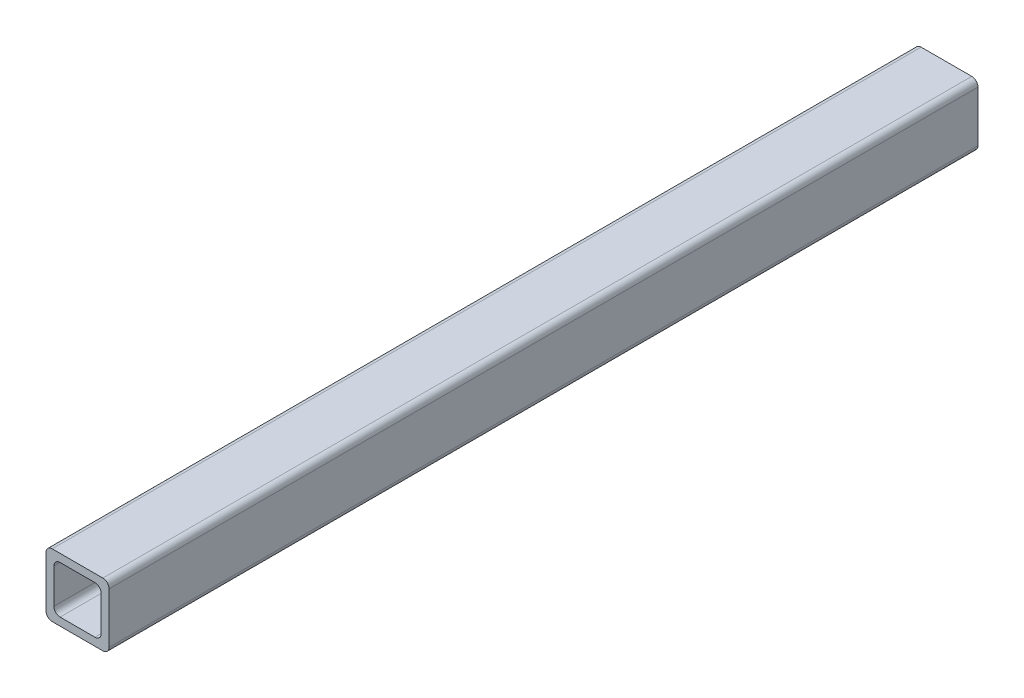
ISO-10303-21;
HEADER;
FILE_DESCRIPTION(('STEP AP214'),'2;1');
FILE_NAME('part.step','',(''),(''),'','','');
FILE_SCHEMA(('AUTOMOTIVE_DESIGN { 1 0 10303 214 1 1 1 1 }'));
ENDSEC;
DATA;
#1=APPLICATION_CONTEXT('core data for automotive mechanical design processes');
#2=APPLICATION_PROTOCOL_DEFINITION('international standard','automotive_design',2000,#1);
#3=PRODUCT_CONTEXT('',#1,'mechanical');
#4=PRODUCT('Part','Part','',(#3));
#5=PRODUCT_RELATED_PRODUCT_CATEGORY('part','',(#4));
#6=PRODUCT_DEFINITION_FORMATION('','',#4);
#7=PRODUCT_DEFINITION_CONTEXT('part definition',#1,'design');
#8=PRODUCT_DEFINITION('design','',#6,#7);
#9=PRODUCT_DEFINITION_SHAPE('','',#8);
#10=(LENGTH_UNIT() NAMED_UNIT(*) SI_UNIT(.MILLI.,.METRE.));
#11=(NAMED_UNIT(*) PLANE_ANGLE_UNIT() SI_UNIT($,.RADIAN.));
#12=(NAMED_UNIT(*) SI_UNIT($,.STERADIAN.) SOLID_ANGLE_UNIT());
#13=UNCERTAINTY_MEASURE_WITH_UNIT(LENGTH_MEASURE(1.E-05),#10,'distance_accuracy_value','');
#14=(GEOMETRIC_REPRESENTATION_CONTEXT(3) GLOBAL_UNCERTAINTY_ASSIGNED_CONTEXT((#13)) GLOBAL_UNIT_ASSIGNED_CONTEXT((#10,
#11,#12)) REPRESENTATION_CONTEXT('',''));
#15=CARTESIAN_POINT('',(0.,0.,0.));
#16=DIRECTION('',(0.,0.,1.));
#17=DIRECTION('',(1.,0.,0.));
#18=AXIS2_PLACEMENT_3D('',#15,#16,#17);
#19=CARTESIAN_POINT('',(10.2,-10.2,350.));
#20=DIRECTION('',(0.,0.,-1.));
#21=DIRECTION('',(-1.,0.,0.));
#22=AXIS2_PLACEMENT_3D('',#19,#20,#21);
#23=PLANE('',#22);
#24=CARTESIAN_POINT('',(10.2,-10.2,350.));
#25=DIRECTION('',(0.,0.,1.));
#26=DIRECTION('',(-1.,0.,0.));
#27=AXIS2_PLACEMENT_3D('',#24,#25,#26);
#28=CIRCLE('',#27,2.5);
#29=CARTESIAN_POINT('',(10.2,-12.7,350.));
#30=VERTEX_POINT('',#29);
#31=CARTESIAN_POINT('',(12.7,-10.2,350.));
#32=VERTEX_POINT('',#31);
#33=EDGE_CURVE('E216',#30,#32,#28,.T.);
#34=ORIENTED_EDGE('',*,*,#33,.T.);
#35=DIRECTION('',(0.,1.,0.));
#36=VECTOR('',#35,1.);
#37=CARTESIAN_POINT('',(12.7,-10.2,350.));
#38=LINE('',#37,#36);
#39=CARTESIAN_POINT('',(12.7,10.2,350.));
#40=VERTEX_POINT('',#39);
#41=EDGE_CURVE('E219',#32,#40,#38,.T.);
#42=ORIENTED_EDGE('',*,*,#41,.T.);
#43=CARTESIAN_POINT('',(10.2,10.2,350.));
#44=DIRECTION('',(0.,0.,1.));
#45=DIRECTION('',(1.,0.,0.));
#46=AXIS2_PLACEMENT_3D('',#43,#44,#45);
#47=CIRCLE('',#46,2.5);
#48=CARTESIAN_POINT('',(10.2,12.7,350.));
#49=VERTEX_POINT('',#48);
#50=EDGE_CURVE('E222',#40,#49,#47,.T.);
#51=ORIENTED_EDGE('',*,*,#50,.T.);
#52=DIRECTION('',(-1.,0.,0.));
#53=VECTOR('',#52,1.);
#54=CARTESIAN_POINT('',(-10.2,12.7,350.));
#55=LINE('',#54,#53);
#56=CARTESIAN_POINT('',(-10.2,12.7,350.));
#57=VERTEX_POINT('',#56);
#58=EDGE_CURVE('E224',#49,#57,#55,.T.);
#59=ORIENTED_EDGE('',*,*,#58,.T.);
#60=CARTESIAN_POINT('',(-10.2,10.2,350.));
#61=DIRECTION('',(0.,0.,1.));
#62=DIRECTION('',(1.,0.,0.));
#63=AXIS2_PLACEMENT_3D('',#60,#61,#62);
#64=CIRCLE('',#63,2.5);
#65=CARTESIAN_POINT('',(-12.7,10.2,350.));
#66=VERTEX_POINT('',#65);
#67=EDGE_CURVE('E226',#57,#66,#64,.T.);
#68=ORIENTED_EDGE('',*,*,#67,.T.);
#69=DIRECTION('',(0.,-1.,0.));
#70=VECTOR('',#69,1.);
#71=CARTESIAN_POINT('',(-12.7,-10.2,350.));
#72=LINE('',#71,#70);
#73=CARTESIAN_POINT('',(-12.7,-10.2,350.));
#74=VERTEX_POINT('',#73);
#75=EDGE_CURVE('E228',#66,#74,#72,.T.);
#76=ORIENTED_EDGE('',*,*,#75,.T.);
#77=CARTESIAN_POINT('',(-10.2,-10.2,350.));
#78=DIRECTION('',(0.,0.,1.));
#79=DIRECTION('',(-1.,0.,0.));
#80=AXIS2_PLACEMENT_3D('',#77,#78,#79);
#81=CIRCLE('',#80,2.5);
#82=CARTESIAN_POINT('',(-10.2,-12.7,350.));
#83=VERTEX_POINT('',#82);
#84=EDGE_CURVE('E230',#74,#83,#81,.T.);
#85=ORIENTED_EDGE('',*,*,#84,.T.);
#86=DIRECTION('',(1.,0.,0.));
#87=VECTOR('',#86,1.);
#88=CARTESIAN_POINT('',(-10.2,-12.7,350.));
#89=LINE('',#88,#87);
#90=EDGE_CURVE('E232',#83,#30,#89,.T.);
#91=ORIENTED_EDGE('',*,*,#90,.T.);
#92=EDGE_LOOP('',(#34,#42,#51,#59,#68,#76,#85,#91));
#93=FACE_BOUND('',#92,.T.);
#94=CARTESIAN_POINT('',(-7.02500000000001,-7.02499999999998,350.));
#95=DIRECTION('',(0.,0.,1.));
#96=DIRECTION('',(-1.,0.,0.));
#97=AXIS2_PLACEMENT_3D('',#94,#95,#96);
#98=CIRCLE('',#97,2.5);
#99=CARTESIAN_POINT('',(-9.52500000000001,-7.02499999999998,350.));
#100=VERTEX_POINT('',#99);
#101=CARTESIAN_POINT('',(-7.02500000000001,-9.52499999999998,350.));
#102=VERTEX_POINT('',#101);
#103=EDGE_CURVE('E151',#100,#102,#98,.T.);
#104=ORIENTED_EDGE('',*,*,#103,.F.);
#105=DIRECTION('',(0.,-1.,0.));
#106=VECTOR('',#105,1.);
#107=CARTESIAN_POINT('',(-9.52500000000001,-7.02499999999998,350.));
#108=LINE('',#107,#106);
#109=CARTESIAN_POINT('',(-9.52500000000001,7.025,350.));
#110=VERTEX_POINT('',#109);
#111=EDGE_CURVE('E184',#110,#100,#108,.T.);
#112=ORIENTED_EDGE('',*,*,#111,.F.);
#113=CARTESIAN_POINT('',(-7.025,7.025,350.));
#114=DIRECTION('',(0.,0.,1.));
#115=DIRECTION('',(-1.,0.,0.));
#116=AXIS2_PLACEMENT_3D('',#113,#114,#115);
#117=CIRCLE('',#116,2.5);
#118=CARTESIAN_POINT('',(-7.025,9.52500000000001,350.));
#119=VERTEX_POINT('',#118);
#120=EDGE_CURVE('E182',#119,#110,#117,.T.);
#121=ORIENTED_EDGE('',*,*,#120,.F.);
#122=DIRECTION('',(-1.,0.,0.));
#123=VECTOR('',#122,1.);
#124=CARTESIAN_POINT('',(-7.025,9.52500000000001,350.));
#125=LINE('',#124,#123);
#126=CARTESIAN_POINT('',(7.02499999999999,9.52500000000001,350.));
#127=VERTEX_POINT('',#126);
#128=EDGE_CURVE('E180',#127,#119,#125,.T.);
#129=ORIENTED_EDGE('',*,*,#128,.F.);
#130=CARTESIAN_POINT('',(7.02499999999999,7.025,350.));
#131=DIRECTION('',(0.,0.,1.));
#132=DIRECTION('',(1.,0.,0.));
#133=AXIS2_PLACEMENT_3D('',#130,#131,#132);
#134=CIRCLE('',#133,2.5);
#135=CARTESIAN_POINT('',(9.52499999999999,7.025,350.));
#136=VERTEX_POINT('',#135);
#137=EDGE_CURVE('E178',#136,#127,#134,.T.);
#138=ORIENTED_EDGE('',*,*,#137,.F.);
#139=DIRECTION('',(0.,1.,0.));
#140=VECTOR('',#139,1.);
#141=CARTESIAN_POINT('',(9.52499999999999,-7.02499999999998,350.));
#142=LINE('',#141,#140);
#143=CARTESIAN_POINT('',(9.52499999999999,-7.02499999999998,350.));
#144=VERTEX_POINT('',#143);
#145=EDGE_CURVE('E174',#144,#136,#142,.T.);
#146=ORIENTED_EDGE('',*,*,#145,.F.);
#147=CARTESIAN_POINT('',(7.02499999999999,-7.02499999999998,350.));
#148=DIRECTION('',(0.,0.,1.));
#149=DIRECTION('',(1.,0.,0.));
#150=AXIS2_PLACEMENT_3D('',#147,#148,#149);
#151=CIRCLE('',#150,2.5);
#152=CARTESIAN_POINT('',(7.02499999999999,-9.52499999999998,350.));
#153=VERTEX_POINT('',#152);
#154=EDGE_CURVE('E172',#153,#144,#151,.T.);
#155=ORIENTED_EDGE('',*,*,#154,.F.);
#156=DIRECTION('',(1.,0.,0.));
#157=VECTOR('',#156,1.);
#158=CARTESIAN_POINT('',(-7.02500000000001,-9.52499999999998,350.));
#159=LINE('',#158,#157);
#160=EDGE_CURVE('E159',#102,#153,#159,.T.);
#161=ORIENTED_EDGE('',*,*,#160,.F.);
#162=EDGE_LOOP('',(#104,#112,#121,#129,#138,#146,#155,#161));
#163=FACE_BOUND('',#162,.T.);
#164=ADVANCED_FACE('F38',(#93,#163),#23,.F.);
#165=CARTESIAN_POINT('',(10.2,-10.2,0.));
#166=DIRECTION('',(0.,0.,-1.));
#167=DIRECTION('',(-1.,0.,0.));
#168=AXIS2_PLACEMENT_3D('',#165,#166,#167);
#169=PLANE('',#168);
#170=CARTESIAN_POINT('',(10.2,-10.2,0.));
#171=DIRECTION('',(0.,0.,1.));
#172=DIRECTION('',(-1.,0.,0.));
#173=AXIS2_PLACEMENT_3D('',#170,#171,#172);
#174=CIRCLE('',#173,2.5);
#175=CARTESIAN_POINT('',(10.2,-12.7,0.));
#176=VERTEX_POINT('',#175);
#177=CARTESIAN_POINT('',(12.7,-10.2,0.));
#178=VERTEX_POINT('',#177);
#179=EDGE_CURVE('E167',#176,#178,#174,.T.);
#180=ORIENTED_EDGE('',*,*,#179,.F.);
#181=DIRECTION('',(1.,0.,0.));
#182=VECTOR('',#181,1.);
#183=CARTESIAN_POINT('',(-10.2,-12.7,0.));
#184=LINE('',#183,#182);
#185=CARTESIAN_POINT('',(-10.2,-12.7,0.));
#186=VERTEX_POINT('',#185);
#187=EDGE_CURVE('E220',#186,#176,#184,.T.);
#188=ORIENTED_EDGE('',*,*,#187,.F.);
#189=CARTESIAN_POINT('',(-10.2,-10.2,0.));
#190=DIRECTION('',(0.,0.,1.));
#191=DIRECTION('',(-1.,0.,0.));
#192=AXIS2_PLACEMENT_3D('',#189,#190,#191);
#193=CIRCLE('',#192,2.5);
#194=CARTESIAN_POINT('',(-12.7,-10.2,0.));
#195=VERTEX_POINT('',#194);
#196=EDGE_CURVE('E247',#195,#186,#193,.T.);
#197=ORIENTED_EDGE('',*,*,#196,.F.);
#198=DIRECTION('',(0.,-1.,0.));
#199=VECTOR('',#198,1.);
#200=CARTESIAN_POINT('',(-12.7,-10.2,0.));
#201=LINE('',#200,#199);
#202=CARTESIAN_POINT('',(-12.7,10.2,0.));
#203=VERTEX_POINT('',#202);
#204=EDGE_CURVE('E245',#203,#195,#201,.T.);
#205=ORIENTED_EDGE('',*,*,#204,.F.);
#206=CARTESIAN_POINT('',(-10.2,10.2,0.));
#207=DIRECTION('',(0.,0.,1.));
#208=DIRECTION('',(1.,0.,0.));
#209=AXIS2_PLACEMENT_3D('',#206,#207,#208);
#210=CIRCLE('',#209,2.5);
#211=CARTESIAN_POINT('',(-10.2,12.7,0.));
#212=VERTEX_POINT('',#211);
#213=EDGE_CURVE('E243',#212,#203,#210,.T.);
#214=ORIENTED_EDGE('',*,*,#213,.F.);
#215=DIRECTION('',(-1.,0.,0.));
#216=VECTOR('',#215,1.);
#217=CARTESIAN_POINT('',(-10.2,12.7,0.));
#218=LINE('',#217,#216);
#219=CARTESIAN_POINT('',(10.2,12.7,0.));
#220=VERTEX_POINT('',#219);
#221=EDGE_CURVE('E241',#220,#212,#218,.T.);
#222=ORIENTED_EDGE('',*,*,#221,.F.);
#223=CARTESIAN_POINT('',(10.2,10.2,0.));
#224=DIRECTION('',(0.,0.,1.));
#225=DIRECTION('',(1.,0.,0.));
#226=AXIS2_PLACEMENT_3D('',#223,#224,#225);
#227=CIRCLE('',#226,2.5);
#228=CARTESIAN_POINT('',(12.7,10.2,0.));
#229=VERTEX_POINT('',#228);
#230=EDGE_CURVE('E239',#229,#220,#227,.T.);
#231=ORIENTED_EDGE('',*,*,#230,.F.);
#232=DIRECTION('',(0.,1.,0.));
#233=VECTOR('',#232,1.);
#234=CARTESIAN_POINT('',(12.7,-10.2,0.));
#235=LINE('',#234,#233);
#236=EDGE_CURVE('E237',#178,#229,#235,.T.);
#237=ORIENTED_EDGE('',*,*,#236,.F.);
#238=EDGE_LOOP('',(#180,#188,#197,#205,#214,#222,#231,#237));
#239=FACE_BOUND('',#238,.T.);
#240=DIRECTION('',(0.,-1.,0.));
#241=VECTOR('',#240,1.);
#242=CARTESIAN_POINT('',(-9.52500000000001,-7.02499999999998,0.));
#243=LINE('',#242,#241);
#244=CARTESIAN_POINT('',(-9.52500000000001,7.02500000000001,0.));
#245=VERTEX_POINT('',#244);
#246=CARTESIAN_POINT('',(-9.52500000000001,-7.02499999999998,0.));
#247=VERTEX_POINT('',#246);
#248=EDGE_CURVE('E160',#245,#247,#243,.T.);
#249=ORIENTED_EDGE('',*,*,#248,.T.);
#250=CARTESIAN_POINT('',(-7.02500000000001,-7.02499999999998,0.));
#251=DIRECTION('',(0.,0.,1.));
#252=DIRECTION('',(-1.,0.,0.));
#253=AXIS2_PLACEMENT_3D('',#250,#251,#252);
#254=CIRCLE('',#253,2.5);
#255=CARTESIAN_POINT('',(-7.02500000000001,-9.52499999999998,0.));
#256=VERTEX_POINT('',#255);
#257=EDGE_CURVE('E61',#247,#256,#254,.T.);
#258=ORIENTED_EDGE('',*,*,#257,.T.);
#259=DIRECTION('',(1.,0.,0.));
#260=VECTOR('',#259,1.);
#261=CARTESIAN_POINT('',(-7.02500000000001,-9.52499999999998,0.));
#262=LINE('',#261,#260);
#263=CARTESIAN_POINT('',(7.02499999999999,-9.52499999999998,0.));
#264=VERTEX_POINT('',#263);
#265=EDGE_CURVE('E166',#256,#264,#262,.T.);
#266=ORIENTED_EDGE('',*,*,#265,.T.);
#267=CARTESIAN_POINT('',(7.02499999999999,-7.02499999999998,0.));
#268=DIRECTION('',(0.,0.,1.));
#269=DIRECTION('',(1.,0.,0.));
#270=AXIS2_PLACEMENT_3D('',#267,#268,#269);
#271=CIRCLE('',#270,2.5);
#272=CARTESIAN_POINT('',(9.52499999999999,-7.02499999999998,0.));
#273=VERTEX_POINT('',#272);
#274=EDGE_CURVE('E188',#264,#273,#271,.T.);
#275=ORIENTED_EDGE('',*,*,#274,.T.);
#276=DIRECTION('',(0.,1.,0.));
#277=VECTOR('',#276,1.);
#278=CARTESIAN_POINT('',(9.52499999999999,-7.02499999999998,0.));
#279=LINE('',#278,#277);
#280=CARTESIAN_POINT('',(9.52499999999999,7.025,0.));
#281=VERTEX_POINT('',#280);
#282=EDGE_CURVE('E191',#273,#281,#279,.T.);
#283=ORIENTED_EDGE('',*,*,#282,.T.);
#284=CARTESIAN_POINT('',(7.02499999999999,7.025,0.));
#285=DIRECTION('',(0.,0.,1.));
#286=DIRECTION('',(1.,0.,0.));
#287=AXIS2_PLACEMENT_3D('',#284,#285,#286);
#288=CIRCLE('',#287,2.5);
#289=CARTESIAN_POINT('',(7.02499999999999,9.52500000000001,0.));
#290=VERTEX_POINT('',#289);
#291=EDGE_CURVE('E194',#281,#290,#288,.T.);
#292=ORIENTED_EDGE('',*,*,#291,.T.);
#293=DIRECTION('',(-1.,0.,0.));
#294=VECTOR('',#293,1.);
#295=CARTESIAN_POINT('',(-7.025,9.52500000000001,0.));
#296=LINE('',#295,#294);
#297=CARTESIAN_POINT('',(-7.025,9.52500000000001,0.));
#298=VERTEX_POINT('',#297);
#299=EDGE_CURVE('E197',#290,#298,#296,.T.);
#300=ORIENTED_EDGE('',*,*,#299,.T.);
#301=CARTESIAN_POINT('',(-7.025,7.025,0.));
#302=DIRECTION('',(0.,0.,1.));
#303=DIRECTION('',(-1.,0.,0.));
#304=AXIS2_PLACEMENT_3D('',#301,#302,#303);
#305=CIRCLE('',#304,2.5);
#306=EDGE_CURVE('E200',#298,#245,#305,.T.);
#307=ORIENTED_EDGE('',*,*,#306,.T.);
#308=EDGE_LOOP('',(#249,#258,#266,#275,#283,#292,#300,#307));
#309=FACE_BOUND('',#308,.T.);
#310=ADVANCED_FACE('F277',(#239,#309),#169,.T.);
#311=CARTESIAN_POINT('',(10.2,-10.2,350.));
#312=DIRECTION('',(0.,0.,-1.));
#313=DIRECTION('',(-1.,0.,0.));
#314=AXIS2_PLACEMENT_3D('',#311,#312,#313);
#315=CYLINDRICAL_SURFACE('',#314,2.5);
#316=ORIENTED_EDGE('',*,*,#179,.T.);
#317=DIRECTION('',(0.,0.,-1.));
#318=VECTOR('',#317,1.);
#319=CARTESIAN_POINT('',(12.7,-10.2,350.));
#320=LINE('',#319,#318);
#321=EDGE_CURVE('E11',#32,#178,#320,.T.);
#322=ORIENTED_EDGE('',*,*,#321,.F.);
#323=ORIENTED_EDGE('',*,*,#33,.F.);
#324=DIRECTION('',(0.,0.,-1.));
#325=VECTOR('',#324,1.);
#326=CARTESIAN_POINT('',(10.2,-12.7,350.));
#327=LINE('',#326,#325);
#328=EDGE_CURVE('E234',#30,#176,#327,.T.);
#329=ORIENTED_EDGE('',*,*,#328,.T.);
#330=EDGE_LOOP('',(#316,#322,#323,#329));
#331=FACE_BOUND('',#330,.T.);
#332=ADVANCED_FACE('F40',(#331),#315,.T.);
#333=CARTESIAN_POINT('',(12.7,-10.2,350.));
#334=DIRECTION('',(-1.,0.,0.));
#335=DIRECTION('',(0.,-1.,0.));
#336=AXIS2_PLACEMENT_3D('',#333,#334,#335);
#337=PLANE('',#336);
#338=ORIENTED_EDGE('',*,*,#236,.T.);
#339=DIRECTION('',(0.,0.,-1.));
#340=VECTOR('',#339,1.);
#341=CARTESIAN_POINT('',(12.7,10.2,350.));
#342=LINE('',#341,#340);
#343=EDGE_CURVE('E46',#40,#229,#342,.T.);
#344=ORIENTED_EDGE('',*,*,#343,.F.);
#345=ORIENTED_EDGE('',*,*,#41,.F.);
#346=ORIENTED_EDGE('',*,*,#321,.T.);
#347=EDGE_LOOP('',(#338,#344,#345,#346));
#348=FACE_BOUND('',#347,.T.);
#349=ADVANCED_FACE('F294',(#348),#337,.F.);
#350=CARTESIAN_POINT('',(10.2,10.2,350.));
#351=DIRECTION('',(0.,0.,-1.));
#352=DIRECTION('',(-1.,0.,0.));
#353=AXIS2_PLACEMENT_3D('',#350,#351,#352);
#354=CYLINDRICAL_SURFACE('',#353,2.5);
#355=ORIENTED_EDGE('',*,*,#230,.T.);
#356=DIRECTION('',(0.,0.,-1.));
#357=VECTOR('',#356,1.);
#358=CARTESIAN_POINT('',(10.2,12.7,350.));
#359=LINE('',#358,#357);
#360=EDGE_CURVE('E264',#49,#220,#359,.T.);
#361=ORIENTED_EDGE('',*,*,#360,.F.);
#362=ORIENTED_EDGE('',*,*,#50,.F.);
#363=ORIENTED_EDGE('',*,*,#343,.T.);
#364=EDGE_LOOP('',(#355,#361,#362,#363));
#365=FACE_BOUND('',#364,.T.);
#366=ADVANCED_FACE('F271',(#365),#354,.T.);
#367=CARTESIAN_POINT('',(-10.2,12.7,350.));
#368=DIRECTION('',(0.,-1.,0.));
#369=DIRECTION('',(1.,0.,0.));
#370=AXIS2_PLACEMENT_3D('',#367,#368,#369);
#371=PLANE('',#370);
#372=ORIENTED_EDGE('',*,*,#221,.T.);
#373=DIRECTION('',(0.,0.,-1.));
#374=VECTOR('',#373,1.);
#375=CARTESIAN_POINT('',(-10.2,12.7,350.));
#376=LINE('',#375,#374);
#377=EDGE_CURVE('E261',#57,#212,#376,.T.);
#378=ORIENTED_EDGE('',*,*,#377,.F.);
#379=ORIENTED_EDGE('',*,*,#58,.F.);
#380=ORIENTED_EDGE('',*,*,#360,.T.);
#381=EDGE_LOOP('',(#372,#378,#379,#380));
#382=FACE_BOUND('',#381,.T.);
#383=ADVANCED_FACE('F283',(#382),#371,.F.);
#384=CARTESIAN_POINT('',(-10.2,10.2,350.));
#385=DIRECTION('',(0.,0.,-1.));
#386=DIRECTION('',(-1.,0.,0.));
#387=AXIS2_PLACEMENT_3D('',#384,#385,#386);
#388=CYLINDRICAL_SURFACE('',#387,2.5);
#389=ORIENTED_EDGE('',*,*,#213,.T.);
#390=DIRECTION('',(0.,0.,-1.));
#391=VECTOR('',#390,1.);
#392=CARTESIAN_POINT('',(-12.7,10.2,350.));
#393=LINE('',#392,#391);
#394=EDGE_CURVE('E258',#66,#203,#393,.T.);
#395=ORIENTED_EDGE('',*,*,#394,.F.);
#396=ORIENTED_EDGE('',*,*,#67,.F.);
#397=ORIENTED_EDGE('',*,*,#377,.T.);
#398=EDGE_LOOP('',(#389,#395,#396,#397));
#399=FACE_BOUND('',#398,.T.);
#400=ADVANCED_FACE('F287',(#399),#388,.T.);
#401=CARTESIAN_POINT('',(-12.7,-10.2,350.));
#402=DIRECTION('',(1.,0.,0.));
#403=DIRECTION('',(0.,0.,-1.));
#404=AXIS2_PLACEMENT_3D('',#401,#402,#403);
#405=PLANE('',#404);
#406=ORIENTED_EDGE('',*,*,#204,.T.);
#407=DIRECTION('',(0.,0.,-1.));
#408=VECTOR('',#407,1.);
#409=CARTESIAN_POINT('',(-12.7,-10.2,350.));
#410=LINE('',#409,#408);
#411=EDGE_CURVE('E255',#74,#195,#410,.T.);
#412=ORIENTED_EDGE('',*,*,#411,.F.);
#413=ORIENTED_EDGE('',*,*,#75,.F.);
#414=ORIENTED_EDGE('',*,*,#394,.T.);
#415=EDGE_LOOP('',(#406,#412,#413,#414));
#416=FACE_BOUND('',#415,.T.);
#417=ADVANCED_FACE('F307',(#416),#405,.F.);
#418=CARTESIAN_POINT('',(-10.2,-10.2,350.));
#419=DIRECTION('',(0.,0.,-1.));
#420=DIRECTION('',(-1.,0.,0.));
#421=AXIS2_PLACEMENT_3D('',#418,#419,#420);
#422=CYLINDRICAL_SURFACE('',#421,2.5);
#423=ORIENTED_EDGE('',*,*,#196,.T.);
#424=DIRECTION('',(0.,0.,-1.));
#425=VECTOR('',#424,1.);
#426=CARTESIAN_POINT('',(-10.2,-12.7,350.));
#427=LINE('',#426,#425);
#428=EDGE_CURVE('E252',#83,#186,#427,.T.);
#429=ORIENTED_EDGE('',*,*,#428,.F.);
#430=ORIENTED_EDGE('',*,*,#84,.F.);
#431=ORIENTED_EDGE('',*,*,#411,.T.);
#432=EDGE_LOOP('',(#423,#429,#430,#431));
#433=FACE_BOUND('',#432,.T.);
#434=ADVANCED_FACE('F305',(#433),#422,.T.);
#435=CARTESIAN_POINT('',(-10.2,-12.7,350.));
#436=DIRECTION('',(0.,1.,0.));
#437=DIRECTION('',(0.,0.,1.));
#438=AXIS2_PLACEMENT_3D('',#435,#436,#437);
#439=PLANE('',#438);
#440=ORIENTED_EDGE('',*,*,#187,.T.);
#441=ORIENTED_EDGE('',*,*,#328,.F.);
#442=ORIENTED_EDGE('',*,*,#90,.F.);
#443=ORIENTED_EDGE('',*,*,#428,.T.);
#444=EDGE_LOOP('',(#440,#441,#442,#443));
#445=FACE_BOUND('',#444,.T.);
#446=ADVANCED_FACE('F300',(#445),#439,.F.);
#447=CARTESIAN_POINT('',(-7.02500000000001,-7.02499999999998,350.));
#448=DIRECTION('',(0.,0.,-1.));
#449=DIRECTION('',(-1.,0.,0.));
#450=AXIS2_PLACEMENT_3D('',#447,#448,#449);
#451=CYLINDRICAL_SURFACE('',#450,2.5);
#452=ORIENTED_EDGE('',*,*,#257,.F.);
#453=DIRECTION('',(0.,0.,-1.));
#454=VECTOR('',#453,1.);
#455=CARTESIAN_POINT('',(-9.52500000000001,-7.02499999999998,350.));
#456=LINE('',#455,#454);
#457=EDGE_CURVE('E155',#100,#247,#456,.T.);
#458=ORIENTED_EDGE('',*,*,#457,.F.);
#459=ORIENTED_EDGE('',*,*,#103,.T.);
#460=DIRECTION('',(0.,0.,-1.));
#461=VECTOR('',#460,1.);
#462=CARTESIAN_POINT('',(-7.02500000000001,-9.52499999999998,350.));
#463=LINE('',#462,#461);
#464=EDGE_CURVE('E154',#102,#256,#463,.T.);
#465=ORIENTED_EDGE('',*,*,#464,.T.);
#466=EDGE_LOOP('',(#452,#458,#459,#465));
#467=FACE_BOUND('',#466,.T.);
#468=ADVANCED_FACE('F153',(#467),#451,.F.);
#469=CARTESIAN_POINT('',(-7.02500000000001,-9.52499999999998,350.));
#470=DIRECTION('',(0.,1.,0.));
#471=DIRECTION('',(0.,0.,1.));
#472=AXIS2_PLACEMENT_3D('',#469,#470,#471);
#473=PLANE('',#472);
#474=ORIENTED_EDGE('',*,*,#265,.F.);
#475=ORIENTED_EDGE('',*,*,#464,.F.);
#476=ORIENTED_EDGE('',*,*,#160,.T.);
#477=DIRECTION('',(0.,0.,-1.));
#478=VECTOR('',#477,1.);
#479=CARTESIAN_POINT('',(7.02499999999999,-9.52499999999998,350.));
#480=LINE('',#479,#478);
#481=EDGE_CURVE('E168',#153,#264,#480,.T.);
#482=ORIENTED_EDGE('',*,*,#481,.T.);
#483=EDGE_LOOP('',(#474,#475,#476,#482));
#484=FACE_BOUND('',#483,.T.);
#485=ADVANCED_FACE('F163',(#484),#473,.T.);
#486=CARTESIAN_POINT('',(7.02499999999999,-7.02499999999998,350.));
#487=DIRECTION('',(0.,0.,-1.));
#488=DIRECTION('',(-1.,0.,0.));
#489=AXIS2_PLACEMENT_3D('',#486,#487,#488);
#490=CYLINDRICAL_SURFACE('',#489,2.5);
#491=ORIENTED_EDGE('',*,*,#274,.F.);
#492=ORIENTED_EDGE('',*,*,#481,.F.);
#493=ORIENTED_EDGE('',*,*,#154,.T.);
#494=DIRECTION('',(0.,0.,-1.));
#495=VECTOR('',#494,1.);
#496=CARTESIAN_POINT('',(9.52499999999999,-7.02499999999998,350.));
#497=LINE('',#496,#495);
#498=EDGE_CURVE('E213',#144,#273,#497,.T.);
#499=ORIENTED_EDGE('',*,*,#498,.T.);
#500=EDGE_LOOP('',(#491,#492,#493,#499));
#501=FACE_BOUND('',#500,.T.);
#502=ADVANCED_FACE('F332',(#501),#490,.F.);
#503=CARTESIAN_POINT('',(9.52499999999999,-7.02499999999998,350.));
#504=DIRECTION('',(-1.,0.,0.));
#505=DIRECTION('',(0.,-1.,0.));
#506=AXIS2_PLACEMENT_3D('',#503,#504,#505);
#507=PLANE('',#506);
#508=ORIENTED_EDGE('',*,*,#282,.F.);
#509=ORIENTED_EDGE('',*,*,#498,.F.);
#510=ORIENTED_EDGE('',*,*,#145,.T.);
#511=DIRECTION('',(0.,0.,-1.));
#512=VECTOR('',#511,1.);
#513=CARTESIAN_POINT('',(9.52499999999999,7.025,350.));
#514=LINE('',#513,#512);
#515=EDGE_CURVE('E211',#136,#281,#514,.T.);
#516=ORIENTED_EDGE('',*,*,#515,.T.);
#517=EDGE_LOOP('',(#508,#509,#510,#516));
#518=FACE_BOUND('',#517,.T.);
#519=ADVANCED_FACE('F336',(#518),#507,.T.);
#520=CARTESIAN_POINT('',(7.02499999999999,7.025,350.));
#521=DIRECTION('',(0.,0.,-1.));
#522=DIRECTION('',(-1.,0.,0.));
#523=AXIS2_PLACEMENT_3D('',#520,#521,#522);
#524=CYLINDRICAL_SURFACE('',#523,2.5);
#525=ORIENTED_EDGE('',*,*,#291,.F.);
#526=ORIENTED_EDGE('',*,*,#515,.F.);
#527=ORIENTED_EDGE('',*,*,#137,.T.);
#528=DIRECTION('',(0.,0.,-1.));
#529=VECTOR('',#528,1.);
#530=CARTESIAN_POINT('',(7.02499999999999,9.52500000000001,350.));
#531=LINE('',#530,#529);
#532=EDGE_CURVE('E209',#127,#290,#531,.T.);
#533=ORIENTED_EDGE('',*,*,#532,.T.);
#534=EDGE_LOOP('',(#525,#526,#527,#533));
#535=FACE_BOUND('',#534,.T.);
#536=ADVANCED_FACE('F342',(#535),#524,.F.);
#537=CARTESIAN_POINT('',(-7.025,9.52500000000001,350.));
#538=DIRECTION('',(0.,-1.,0.));
#539=DIRECTION('',(0.,0.,-1.));
#540=AXIS2_PLACEMENT_3D('',#537,#538,#539);
#541=PLANE('',#540);
#542=ORIENTED_EDGE('',*,*,#299,.F.);
#543=ORIENTED_EDGE('',*,*,#532,.F.);
#544=ORIENTED_EDGE('',*,*,#128,.T.);
#545=DIRECTION('',(0.,0.,-1.));
#546=VECTOR('',#545,1.);
#547=CARTESIAN_POINT('',(-7.025,9.52500000000001,350.));
#548=LINE('',#547,#546);
#549=EDGE_CURVE('E207',#119,#298,#548,.T.);
#550=ORIENTED_EDGE('',*,*,#549,.T.);
#551=EDGE_LOOP('',(#542,#543,#544,#550));
#552=FACE_BOUND('',#551,.T.);
#553=ADVANCED_FACE('F346',(#552),#541,.T.);
#554=CARTESIAN_POINT('',(-7.025,7.025,350.));
#555=DIRECTION('',(0.,0.,-1.));
#556=DIRECTION('',(-1.,0.,0.));
#557=AXIS2_PLACEMENT_3D('',#554,#555,#556);
#558=CYLINDRICAL_SURFACE('',#557,2.5);
#559=ORIENTED_EDGE('',*,*,#306,.F.);
#560=ORIENTED_EDGE('',*,*,#549,.F.);
#561=ORIENTED_EDGE('',*,*,#120,.T.);
#562=DIRECTION('',(0.,0.,-1.));
#563=VECTOR('',#562,1.);
#564=CARTESIAN_POINT('',(-9.52500000000001,7.02500000000001,350.));
#565=LINE('',#564,#563);
#566=EDGE_CURVE('E53',#110,#245,#565,.T.);
#567=ORIENTED_EDGE('',*,*,#566,.T.);
#568=EDGE_LOOP('',(#559,#560,#561,#567));
#569=FACE_BOUND('',#568,.T.);
#570=ADVANCED_FACE('F350',(#569),#558,.F.);
#571=CARTESIAN_POINT('',(-9.52500000000001,-7.02499999999998,350.));
#572=DIRECTION('',(1.,0.,0.));
#573=DIRECTION('',(0.,0.,-1.));
#574=AXIS2_PLACEMENT_3D('',#571,#572,#573);
#575=PLANE('',#574);
#576=ORIENTED_EDGE('',*,*,#248,.F.);
#577=ORIENTED_EDGE('',*,*,#566,.F.);
#578=ORIENTED_EDGE('',*,*,#111,.T.);
#579=ORIENTED_EDGE('',*,*,#457,.T.);
#580=EDGE_LOOP('',(#576,#577,#578,#579));
#581=FACE_BOUND('',#580,.T.);
#582=ADVANCED_FACE('F354',(#581),#575,.T.);
#583=CLOSED_SHELL('',(#164,#310,#332,#349,#366,#383,#400,#417,#434,#446,#468,#485,#502,#519,
#536,#553,#570,#582));
#584=MANIFOLD_SOLID_BREP('B2',#583);
#585=ADVANCED_BREP_SHAPE_REPRESENTATION('',(#18,#584),#14);
#586=SHAPE_DEFINITION_REPRESENTATION(#9,#585);
ENDSEC;
END-ISO-10303-21;
